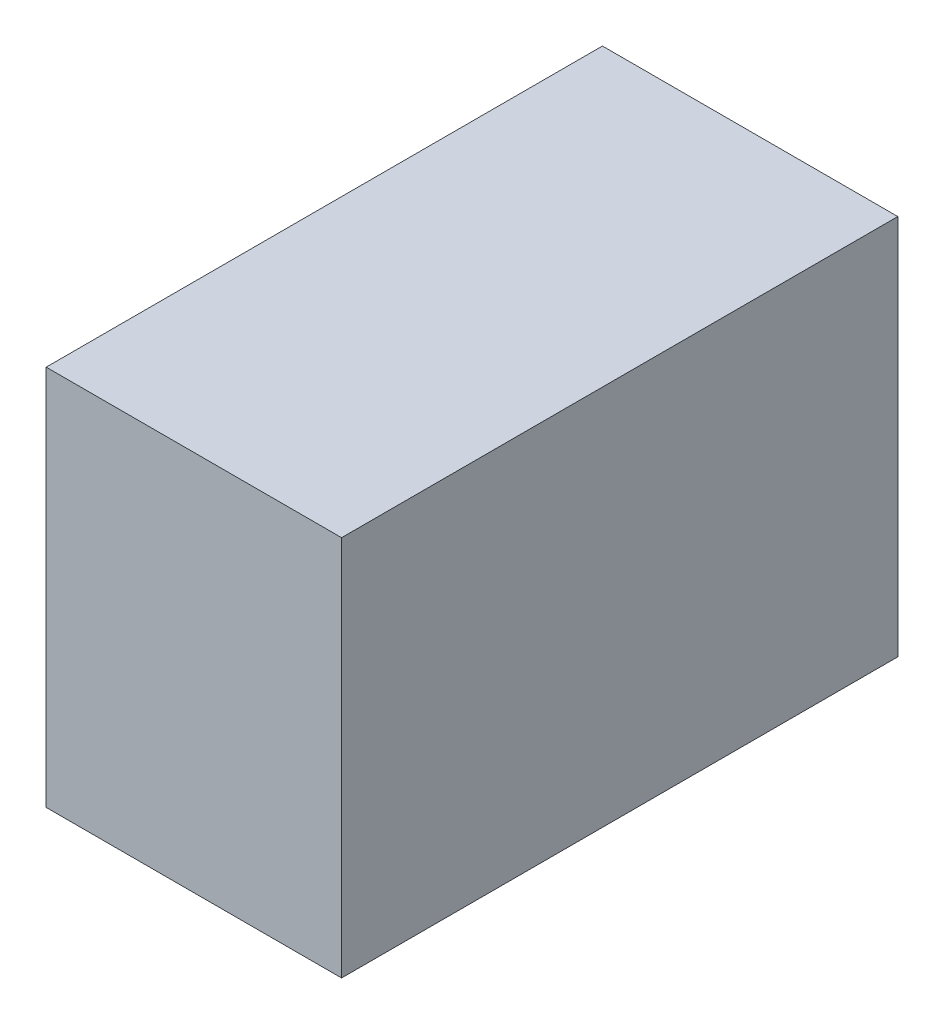
ISO-10303-21;
HEADER;
FILE_DESCRIPTION(('STEP AP214'),'2;1');
FILE_NAME('part.step','',(''),(''),'','','');
FILE_SCHEMA(('AUTOMOTIVE_DESIGN { 1 0 10303 214 1 1 1 1 }'));
ENDSEC;
DATA;
#1=APPLICATION_CONTEXT('core data for automotive mechanical design processes');
#2=APPLICATION_PROTOCOL_DEFINITION('international standard','automotive_design',2000,#1);
#3=PRODUCT_CONTEXT('',#1,'mechanical');
#4=PRODUCT('Part','Part','',(#3));
#5=PRODUCT_RELATED_PRODUCT_CATEGORY('part','',(#4));
#6=PRODUCT_DEFINITION_FORMATION('','',#4);
#7=PRODUCT_DEFINITION_CONTEXT('part definition',#1,'design');
#8=PRODUCT_DEFINITION('design','',#6,#7);
#9=PRODUCT_DEFINITION_SHAPE('','',#8);
#10=(LENGTH_UNIT() NAMED_UNIT(*) SI_UNIT(.MILLI.,.METRE.));
#11=(NAMED_UNIT(*) PLANE_ANGLE_UNIT() SI_UNIT($,.RADIAN.));
#12=(NAMED_UNIT(*) SI_UNIT($,.STERADIAN.) SOLID_ANGLE_UNIT());
#13=UNCERTAINTY_MEASURE_WITH_UNIT(LENGTH_MEASURE(1.E-05),#10,'distance_accuracy_value','');
#14=(GEOMETRIC_REPRESENTATION_CONTEXT(3) GLOBAL_UNCERTAINTY_ASSIGNED_CONTEXT((#13)) GLOBAL_UNIT_ASSIGNED_CONTEXT((#10,
#11,#12)) REPRESENTATION_CONTEXT('',''));
#15=CARTESIAN_POINT('',(0.,0.,0.));
#16=DIRECTION('',(0.,0.,1.));
#17=DIRECTION('',(1.,0.,0.));
#18=AXIS2_PLACEMENT_3D('',#15,#16,#17);
#19=CARTESIAN_POINT('',(6.21999999999999,53.841103799901,44.78));
#20=DIRECTION('',(1.,0.,0.));
#21=DIRECTION('',(0.,1.,0.));
#22=AXIS2_PLACEMENT_3D('',#19,#20,#21);
#23=PLANE('',#22);
#24=DIRECTION('',(0.,-1.,0.));
#25=VECTOR('',#24,1.);
#26=CARTESIAN_POINT('',(6.21999999999999,53.841103799901,0.));
#27=LINE('',#26,#25);
#28=CARTESIAN_POINT('',(6.21999999999999,53.841103799901,0.));
#29=VERTEX_POINT('',#28);
#30=CARTESIAN_POINT('',(6.22,23.141103799901,0.));
#31=VERTEX_POINT('',#30);
#32=EDGE_CURVE('E97',#29,#31,#27,.T.);
#33=ORIENTED_EDGE('',*,*,#32,.T.);
#34=DIRECTION('',(0.,0.,-1.));
#35=VECTOR('',#34,1.);
#36=CARTESIAN_POINT('',(6.22,23.141103799901,44.78));
#37=LINE('',#36,#35);
#38=CARTESIAN_POINT('',(6.22,23.141103799901,44.78));
#39=VERTEX_POINT('',#38);
#40=EDGE_CURVE('E11',#39,#31,#37,.T.);
#41=ORIENTED_EDGE('',*,*,#40,.F.);
#42=DIRECTION('',(0.,-1.,0.));
#43=VECTOR('',#42,1.);
#44=CARTESIAN_POINT('',(6.21999999999999,53.841103799901,44.78));
#45=LINE('',#44,#43);
#46=CARTESIAN_POINT('',(6.21999999999999,53.841103799901,44.78));
#47=VERTEX_POINT('',#46);
#48=EDGE_CURVE('E85',#47,#39,#45,.T.);
#49=ORIENTED_EDGE('',*,*,#48,.F.);
#50=DIRECTION('',(0.,0.,-1.));
#51=VECTOR('',#50,1.);
#52=CARTESIAN_POINT('',(6.21999999999999,53.841103799901,44.78));
#53=LINE('',#52,#51);
#54=EDGE_CURVE('E93',#47,#29,#53,.T.);
#55=ORIENTED_EDGE('',*,*,#54,.T.);
#56=EDGE_LOOP('',(#33,#41,#49,#55));
#57=FACE_BOUND('',#56,.T.);
#58=ADVANCED_FACE('F34',(#57),#23,.F.);
#59=CARTESIAN_POINT('',(6.22,23.141103799901,44.78));
#60=DIRECTION('',(0.,1.,0.));
#61=DIRECTION('',(0.,0.,1.));
#62=AXIS2_PLACEMENT_3D('',#59,#60,#61);
#63=PLANE('',#62);
#64=DIRECTION('',(1.,0.,0.));
#65=VECTOR('',#64,1.);
#66=CARTESIAN_POINT('',(6.22,23.141103799901,0.));
#67=LINE('',#66,#65);
#68=CARTESIAN_POINT('',(30.,23.141103799901,0.));
#69=VERTEX_POINT('',#68);
#70=EDGE_CURVE('E89',#31,#69,#67,.T.);
#71=ORIENTED_EDGE('',*,*,#70,.T.);
#72=DIRECTION('',(0.,0.,-1.));
#73=VECTOR('',#72,1.);
#74=CARTESIAN_POINT('',(30.,23.141103799901,44.78));
#75=LINE('',#74,#73);
#76=CARTESIAN_POINT('',(30.,23.141103799901,44.78));
#77=VERTEX_POINT('',#76);
#78=EDGE_CURVE('E42',#77,#69,#75,.T.);
#79=ORIENTED_EDGE('',*,*,#78,.F.);
#80=DIRECTION('',(1.,0.,0.));
#81=VECTOR('',#80,1.);
#82=CARTESIAN_POINT('',(6.22,23.141103799901,44.78));
#83=LINE('',#82,#81);
#84=EDGE_CURVE('E80',#39,#77,#83,.T.);
#85=ORIENTED_EDGE('',*,*,#84,.F.);
#86=ORIENTED_EDGE('',*,*,#40,.T.);
#87=EDGE_LOOP('',(#71,#79,#85,#86));
#88=FACE_BOUND('',#87,.T.);
#89=ADVANCED_FACE('F88',(#88),#63,.F.);
#90=CARTESIAN_POINT('',(30.,53.841103799901,44.78));
#91=DIRECTION('',(-1.,0.,0.));
#92=DIRECTION('',(0.,-1.,0.));
#93=AXIS2_PLACEMENT_3D('',#90,#91,#92);
#94=PLANE('',#93);
#95=DIRECTION('',(0.,1.,0.));
#96=VECTOR('',#95,1.);
#97=CARTESIAN_POINT('',(30.,53.841103799901,0.));
#98=LINE('',#97,#96);
#99=CARTESIAN_POINT('',(30.,53.841103799901,0.));
#100=VERTEX_POINT('',#99);
#101=EDGE_CURVE('E67',#69,#100,#98,.T.);
#102=ORIENTED_EDGE('',*,*,#101,.T.);
#103=DIRECTION('',(0.,0.,-1.));
#104=VECTOR('',#103,1.);
#105=CARTESIAN_POINT('',(30.,53.841103799901,44.78));
#106=LINE('',#105,#104);
#107=CARTESIAN_POINT('',(30.,53.841103799901,44.78));
#108=VERTEX_POINT('',#107);
#109=EDGE_CURVE('E90',#108,#100,#106,.T.);
#110=ORIENTED_EDGE('',*,*,#109,.F.);
#111=DIRECTION('',(0.,1.,0.));
#112=VECTOR('',#111,1.);
#113=CARTESIAN_POINT('',(30.,53.841103799901,44.78));
#114=LINE('',#113,#112);
#115=EDGE_CURVE('E83',#77,#108,#114,.T.);
#116=ORIENTED_EDGE('',*,*,#115,.F.);
#117=ORIENTED_EDGE('',*,*,#78,.T.);
#118=EDGE_LOOP('',(#102,#110,#116,#117));
#119=FACE_BOUND('',#118,.T.);
#120=ADVANCED_FACE('F91',(#119),#94,.F.);
#121=CARTESIAN_POINT('',(6.21999999999999,53.841103799901,44.78));
#122=DIRECTION('',(0.,-1.,0.));
#123=DIRECTION('',(0.,0.,-1.));
#124=AXIS2_PLACEMENT_3D('',#121,#122,#123);
#125=PLANE('',#124);
#126=DIRECTION('',(-1.,0.,0.));
#127=VECTOR('',#126,1.);
#128=CARTESIAN_POINT('',(6.21999999999999,53.841103799901,0.));
#129=LINE('',#128,#127);
#130=EDGE_CURVE('E73',#100,#29,#129,.T.);
#131=ORIENTED_EDGE('',*,*,#130,.T.);
#132=ORIENTED_EDGE('',*,*,#54,.F.);
#133=DIRECTION('',(-1.,0.,0.));
#134=VECTOR('',#133,1.);
#135=CARTESIAN_POINT('',(6.21999999999999,53.841103799901,44.78));
#136=LINE('',#135,#134);
#137=EDGE_CURVE('E50',#108,#47,#136,.T.);
#138=ORIENTED_EDGE('',*,*,#137,.F.);
#139=ORIENTED_EDGE('',*,*,#109,.T.);
#140=EDGE_LOOP('',(#131,#132,#138,#139));
#141=FACE_BOUND('',#140,.T.);
#142=ADVANCED_FACE('F104',(#141),#125,.F.);
#143=CARTESIAN_POINT('',(0.,0.,44.78));
#144=DIRECTION('',(0.,0.,1.));
#145=DIRECTION('',(1.,0.,0.));
#146=AXIS2_PLACEMENT_3D('',#143,#144,#145);
#147=PLANE('',#146);
#148=ORIENTED_EDGE('',*,*,#48,.T.);
#149=ORIENTED_EDGE('',*,*,#84,.T.);
#150=ORIENTED_EDGE('',*,*,#115,.T.);
#151=ORIENTED_EDGE('',*,*,#137,.T.);
#152=EDGE_LOOP('',(#148,#149,#150,#151));
#153=FACE_BOUND('',#152,.T.);
#154=ADVANCED_FACE('F81',(#153),#147,.T.);
#155=CARTESIAN_POINT('',(0.,0.,0.));
#156=DIRECTION('',(0.,0.,1.));
#157=DIRECTION('',(1.,0.,0.));
#158=AXIS2_PLACEMENT_3D('',#155,#156,#157);
#159=PLANE('',#158);
#160=ORIENTED_EDGE('',*,*,#32,.F.);
#161=ORIENTED_EDGE('',*,*,#130,.F.);
#162=ORIENTED_EDGE('',*,*,#101,.F.);
#163=ORIENTED_EDGE('',*,*,#70,.F.);
#164=EDGE_LOOP('',(#160,#161,#162,#163));
#165=FACE_BOUND('',#164,.T.);
#166=ADVANCED_FACE('F107',(#165),#159,.F.);
#167=CLOSED_SHELL('',(#58,#89,#120,#142,#154,#166));
#168=MANIFOLD_SOLID_BREP('B2',#167);
#169=ADVANCED_BREP_SHAPE_REPRESENTATION('',(#18,#168),#14);
#170=SHAPE_DEFINITION_REPRESENTATION(#9,#169);
ENDSEC;
END-ISO-10303-21;
